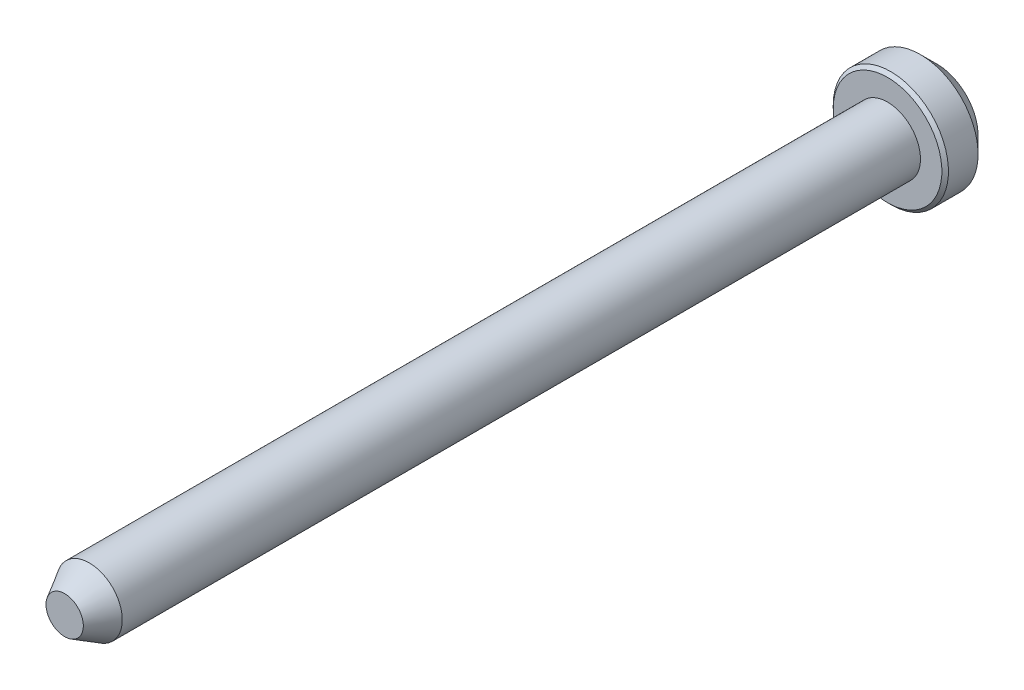
ISO-10303-21;
HEADER;
FILE_DESCRIPTION(('STEP AP214'),'2;1');
FILE_NAME('part.step','',(''),(''),'','','');
FILE_SCHEMA(('AUTOMOTIVE_DESIGN { 1 0 10303 214 1 1 1 1 }'));
ENDSEC;
DATA;
#1=APPLICATION_CONTEXT('core data for automotive mechanical design processes');
#2=APPLICATION_PROTOCOL_DEFINITION('international standard','automotive_design',2000,#1);
#3=PRODUCT_CONTEXT('',#1,'mechanical');
#4=PRODUCT('Part','Part','',(#3));
#5=PRODUCT_RELATED_PRODUCT_CATEGORY('part','',(#4));
#6=PRODUCT_DEFINITION_FORMATION('','',#4);
#7=PRODUCT_DEFINITION_CONTEXT('part definition',#1,'design');
#8=PRODUCT_DEFINITION('design','',#6,#7);
#9=PRODUCT_DEFINITION_SHAPE('','',#8);
#10=(LENGTH_UNIT() NAMED_UNIT(*) SI_UNIT(.MILLI.,.METRE.));
#11=(NAMED_UNIT(*) PLANE_ANGLE_UNIT() SI_UNIT($,.RADIAN.));
#12=(NAMED_UNIT(*) SI_UNIT($,.STERADIAN.) SOLID_ANGLE_UNIT());
#13=UNCERTAINTY_MEASURE_WITH_UNIT(LENGTH_MEASURE(1.E-05),#10,'distance_accuracy_value','');
#14=(GEOMETRIC_REPRESENTATION_CONTEXT(3) GLOBAL_UNCERTAINTY_ASSIGNED_CONTEXT((#13)) GLOBAL_UNIT_ASSIGNED_CONTEXT((#10,
#11,#12)) REPRESENTATION_CONTEXT('',''));
#15=CARTESIAN_POINT('',(0.,0.,0.));
#16=DIRECTION('',(0.,0.,1.));
#17=DIRECTION('',(1.,0.,0.));
#18=AXIS2_PLACEMENT_3D('',#15,#16,#17);
#19=CARTESIAN_POINT('',(1.13397459621557,0.,0.));
#20=DIRECTION('',(0.,0.,-1.));
#21=DIRECTION('',(-1.,0.,0.));
#22=AXIS2_PLACEMENT_3D('',#19,#20,#21);
#23=PLANE('',#22);
#24=CARTESIAN_POINT('',(0.,0.,0.));
#25=DIRECTION('',(0.,0.,-1.));
#26=DIRECTION('',(-1.,0.,0.));
#27=AXIS2_PLACEMENT_3D('',#24,#25,#26);
#28=CIRCLE('',#27,1.13397459621557);
#29=CARTESIAN_POINT('',(-1.13397459621557,0.,0.));
#30=VERTEX_POINT('',#29);
#31=EDGE_CURVE('E58',#30,#30,#28,.T.);
#32=ORIENTED_EDGE('',*,*,#31,.F.);
#33=EDGE_LOOP('',(#32));
#34=FACE_BOUND('',#33,.T.);
#35=ADVANCED_FACE('F32',(#34),#23,.F.);
#36=CARTESIAN_POINT('',(0.,0.,-53.));
#37=DIRECTION('',(0.,0.,1.));
#38=DIRECTION('',(1.,0.,0.));
#39=AXIS2_PLACEMENT_3D('',#36,#37,#38);
#40=PLANE('',#39);
#41=CARTESIAN_POINT('',(0.,0.,-53.));
#42=DIRECTION('',(0.,0.,-1.));
#43=DIRECTION('',(-1.,0.,0.));
#44=AXIS2_PLACEMENT_3D('',#41,#42,#43);
#45=CIRCLE('',#44,2.49999999999999);
#46=CARTESIAN_POINT('',(-2.49999999999999,0.,-53.));
#47=VERTEX_POINT('',#46);
#48=EDGE_CURVE('E43',#47,#47,#45,.T.);
#49=ORIENTED_EDGE('',*,*,#48,.T.);
#50=EDGE_LOOP('',(#49));
#51=FACE_BOUND('',#50,.T.);
#52=ADVANCED_FACE('F65',(#51),#40,.F.);
#53=CARTESIAN_POINT('',(0.,0.,-52.));
#54=DIRECTION('',(0.,0.,1.));
#55=DIRECTION('',(1.,0.,0.));
#56=AXIS2_PLACEMENT_3D('',#53,#54,#55);
#57=CONICAL_SURFACE('',#56,3.49999999999999,0.785398163397449);
#58=ORIENTED_EDGE('',*,*,#48,.F.);
#59=EDGE_LOOP('',(#58));
#60=FACE_BOUND('',#59,.T.);
#61=CARTESIAN_POINT('',(0.,0.,-52.));
#62=DIRECTION('',(0.,0.,-1.));
#63=DIRECTION('',(-1.,0.,0.));
#64=AXIS2_PLACEMENT_3D('',#61,#62,#63);
#65=CIRCLE('',#64,3.49999999999999);
#66=CARTESIAN_POINT('',(-3.49999999999999,0.,-52.));
#67=VERTEX_POINT('',#66);
#68=EDGE_CURVE('E47',#67,#67,#65,.T.);
#69=ORIENTED_EDGE('',*,*,#68,.T.);
#70=EDGE_LOOP('',(#69));
#71=FACE_BOUND('',#70,.T.);
#72=ADVANCED_FACE('F69',(#60,#71),#57,.T.);
#73=CARTESIAN_POINT('',(0.,0.,0.));
#74=DIRECTION('',(0.,0.,-1.));
#75=DIRECTION('',(-1.,0.,0.));
#76=AXIS2_PLACEMENT_3D('',#73,#74,#75);
#77=CYLINDRICAL_SURFACE('',#76,3.49999999999999);
#78=CARTESIAN_POINT('',(0.,0.,-50.2));
#79=DIRECTION('',(0.,0.,-1.));
#80=DIRECTION('',(-1.,0.,0.));
#81=AXIS2_PLACEMENT_3D('',#78,#79,#80);
#82=CIRCLE('',#81,3.49999999999999);
#83=CARTESIAN_POINT('',(-3.49999999999999,0.,-50.2));
#84=VERTEX_POINT('',#83);
#85=EDGE_CURVE('E39',#84,#84,#82,.T.);
#86=ORIENTED_EDGE('',*,*,#85,.T.);
#87=EDGE_LOOP('',(#86));
#88=FACE_BOUND('',#87,.T.);
#89=ORIENTED_EDGE('',*,*,#68,.F.);
#90=EDGE_LOOP('',(#89));
#91=FACE_BOUND('',#90,.T.);
#92=ADVANCED_FACE('F75',(#88,#91),#77,.T.);
#93=CARTESIAN_POINT('',(3.49999999999999,0.,-50.));
#94=DIRECTION('',(0.,0.,-1.));
#95=DIRECTION('',(-1.,0.,0.));
#96=AXIS2_PLACEMENT_3D('',#93,#94,#95);
#97=PLANE('',#96);
#98=CARTESIAN_POINT('',(0.,0.,-50.));
#99=DIRECTION('',(0.,0.,-1.));
#100=DIRECTION('',(-1.,0.,0.));
#101=AXIS2_PLACEMENT_3D('',#98,#99,#100);
#102=CIRCLE('',#101,3.29999999999999);
#103=CARTESIAN_POINT('',(-3.29999999999999,0.,-50.));
#104=VERTEX_POINT('',#103);
#105=EDGE_CURVE('E10',#104,#104,#102,.F.);
#106=ORIENTED_EDGE('',*,*,#105,.T.);
#107=EDGE_LOOP('',(#106));
#108=FACE_BOUND('',#107,.T.);
#109=CARTESIAN_POINT('',(0.,0.,-50.));
#110=DIRECTION('',(0.,0.,-1.));
#111=DIRECTION('',(-1.,0.,0.));
#112=AXIS2_PLACEMENT_3D('',#109,#110,#111);
#113=CIRCLE('',#112,1.99999999999999);
#114=CARTESIAN_POINT('',(-1.99999999999999,0.,-50.));
#115=VERTEX_POINT('',#114);
#116=EDGE_CURVE('E52',#115,#115,#113,.T.);
#117=ORIENTED_EDGE('',*,*,#116,.T.);
#118=EDGE_LOOP('',(#117));
#119=FACE_BOUND('',#118,.T.);
#120=ADVANCED_FACE('F79',(#108,#119),#97,.F.);
#121=CARTESIAN_POINT('',(0.,0.,0.));
#122=DIRECTION('',(0.,0.,-1.));
#123=DIRECTION('',(-1.,0.,0.));
#124=AXIS2_PLACEMENT_3D('',#121,#122,#123);
#125=CYLINDRICAL_SURFACE('',#124,2.);
#126=ORIENTED_EDGE('',*,*,#116,.F.);
#127=EDGE_LOOP('',(#126));
#128=FACE_BOUND('',#127,.T.);
#129=CARTESIAN_POINT('',(0.,0.,-1.5));
#130=DIRECTION('',(0.,0.,-1.));
#131=DIRECTION('',(-1.,0.,0.));
#132=AXIS2_PLACEMENT_3D('',#129,#130,#131);
#133=CIRCLE('',#132,2.);
#134=CARTESIAN_POINT('',(-2.,0.,-1.5));
#135=VERTEX_POINT('',#134);
#136=EDGE_CURVE('E55',#135,#135,#133,.T.);
#137=ORIENTED_EDGE('',*,*,#136,.T.);
#138=EDGE_LOOP('',(#137));
#139=FACE_BOUND('',#138,.T.);
#140=ADVANCED_FACE('F82',(#128,#139),#125,.T.);
#141=CARTESIAN_POINT('',(0.,0.,0.));
#142=DIRECTION('',(0.,0.,-1.));
#143=DIRECTION('',(-1.,0.,0.));
#144=AXIS2_PLACEMENT_3D('',#141,#142,#143);
#145=CONICAL_SURFACE('',#144,1.13397459621557,0.523598775598296);
#146=ORIENTED_EDGE('',*,*,#136,.F.);
#147=EDGE_LOOP('',(#146));
#148=FACE_BOUND('',#147,.T.);
#149=ORIENTED_EDGE('',*,*,#31,.T.);
#150=EDGE_LOOP('',(#149));
#151=FACE_BOUND('',#150,.T.);
#152=ADVANCED_FACE('F62',(#148,#151),#145,.T.);
#153=CARTESIAN_POINT('',(0.,0.,-50.2));
#154=DIRECTION('',(0.,0.,-1.));
#155=DIRECTION('',(-1.,0.,0.));
#156=AXIS2_PLACEMENT_3D('',#153,#154,#155);
#157=CONICAL_SURFACE('',#156,3.49999999999999,0.785398163397445);
#158=ORIENTED_EDGE('',*,*,#105,.F.);
#159=EDGE_LOOP('',(#158));
#160=FACE_BOUND('',#159,.T.);
#161=ORIENTED_EDGE('',*,*,#85,.F.);
#162=EDGE_LOOP('',(#161));
#163=FACE_BOUND('',#162,.T.);
#164=ADVANCED_FACE('F34',(#160,#163),#157,.T.);
#165=CLOSED_SHELL('',(#35,#52,#72,#92,#120,#140,#152,#164));
#166=MANIFOLD_SOLID_BREP('B2',#165);
#167=ADVANCED_BREP_SHAPE_REPRESENTATION('',(#18,#166),#14);
#168=SHAPE_DEFINITION_REPRESENTATION(#9,#167);
ENDSEC;
END-ISO-10303-21;
